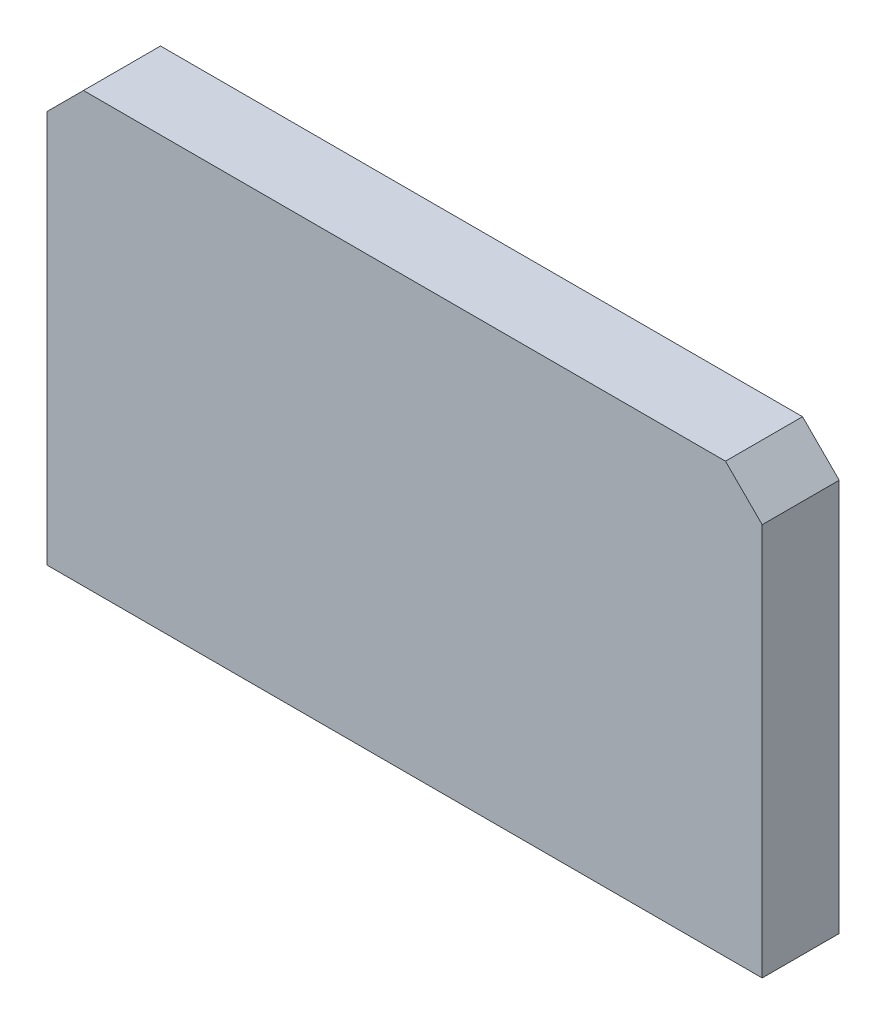
ISO-10303-21;
HEADER;
FILE_DESCRIPTION(('STEP AP214'),'2;1');
FILE_NAME('part.step','',(''),(''),'','','');
FILE_SCHEMA(('AUTOMOTIVE_DESIGN { 1 0 10303 214 1 1 1 1 }'));
ENDSEC;
DATA;
#1=APPLICATION_CONTEXT('core data for automotive mechanical design processes');
#2=APPLICATION_PROTOCOL_DEFINITION('international standard','automotive_design',2000,#1);
#3=PRODUCT_CONTEXT('',#1,'mechanical');
#4=PRODUCT('Part','Part','',(#3));
#5=PRODUCT_RELATED_PRODUCT_CATEGORY('part','',(#4));
#6=PRODUCT_DEFINITION_FORMATION('','',#4);
#7=PRODUCT_DEFINITION_CONTEXT('part definition',#1,'design');
#8=PRODUCT_DEFINITION('design','',#6,#7);
#9=PRODUCT_DEFINITION_SHAPE('','',#8);
#10=(LENGTH_UNIT() NAMED_UNIT(*) SI_UNIT(.MILLI.,.METRE.));
#11=(NAMED_UNIT(*) PLANE_ANGLE_UNIT() SI_UNIT($,.RADIAN.));
#12=(NAMED_UNIT(*) SI_UNIT($,.STERADIAN.) SOLID_ANGLE_UNIT());
#13=UNCERTAINTY_MEASURE_WITH_UNIT(LENGTH_MEASURE(1.E-05),#10,'distance_accuracy_value','');
#14=(GEOMETRIC_REPRESENTATION_CONTEXT(3) GLOBAL_UNCERTAINTY_ASSIGNED_CONTEXT((#13)) GLOBAL_UNIT_ASSIGNED_CONTEXT((#10,
#11,#12)) REPRESENTATION_CONTEXT('',''));
#15=CARTESIAN_POINT('',(0.,0.,0.));
#16=DIRECTION('',(0.,0.,1.));
#17=DIRECTION('',(1.,0.,0.));
#18=AXIS2_PLACEMENT_3D('',#15,#16,#17);
#19=CARTESIAN_POINT('',(-53.5653305643067,-3.20684389745684,0.));
#20=DIRECTION('',(0.,0.,1.));
#21=DIRECTION('',(1.,0.,0.));
#22=AXIS2_PLACEMENT_3D('',#19,#20,#21);
#23=PLANE('',#22);
#24=CARTESIAN_POINT('',(-53.0153305643067,-15.7068438974568,0.));
#25=DIRECTION('',(0.,0.,1.));
#26=DIRECTION('',(1.,0.,0.));
#27=AXIS2_PLACEMENT_3D('',#24,#25,#26);
#28=CIRCLE('',#27,0.925000000000002);
#29=CARTESIAN_POINT('',(-52.0903305643067,-15.7068438974568,0.));
#30=VERTEX_POINT('',#29);
#31=EDGE_CURVE('E141',#30,#30,#28,.F.);
#32=ORIENTED_EDGE('',*,*,#31,.F.);
#33=EDGE_LOOP('',(#32));
#34=FACE_BOUND('',#33,.T.);
#35=CARTESIAN_POINT('',(-53.0153305643067,-11.7068438974568,0.));
#36=DIRECTION('',(0.,0.,1.));
#37=DIRECTION('',(1.,0.,0.));
#38=AXIS2_PLACEMENT_3D('',#35,#36,#37);
#39=CIRCLE('',#38,0.925000000000002);
#40=CARTESIAN_POINT('',(-52.0903305643067,-11.7068438974568,0.));
#41=VERTEX_POINT('',#40);
#42=EDGE_CURVE('E145',#41,#41,#39,.F.);
#43=ORIENTED_EDGE('',*,*,#42,.F.);
#44=EDGE_LOOP('',(#43));
#45=FACE_BOUND('',#44,.T.);
#46=DIRECTION('',(-1.,0.,0.));
#47=VECTOR('',#46,1.);
#48=CARTESIAN_POINT('',(-62.7653305643067,-7.00684389745684,0.));
#49=LINE('',#48,#47);
#50=CARTESIAN_POINT('',(-44.2653305643067,-7.00684389745684,0.));
#51=VERTEX_POINT('',#50);
#52=CARTESIAN_POINT('',(-61.7653305643067,-7.00684389745684,0.));
#53=VERTEX_POINT('',#52);
#54=EDGE_CURVE('E117',#51,#53,#49,.T.);
#55=ORIENTED_EDGE('',*,*,#54,.F.);
#56=DIRECTION('',(-0.707106781186545,0.70710678118655,0.));
#57=VECTOR('',#56,1.);
#58=CARTESIAN_POINT('',(-44.2653305643067,-7.00684389745684,0.));
#59=LINE('',#58,#57);
#60=CARTESIAN_POINT('',(-43.2653305643067,-8.00684389745684,0.));
#61=VERTEX_POINT('',#60);
#62=EDGE_CURVE('E156',#51,#61,#59,.F.);
#63=ORIENTED_EDGE('',*,*,#62,.T.);
#64=DIRECTION('',(0.,1.,0.));
#65=VECTOR('',#64,1.);
#66=CARTESIAN_POINT('',(-43.2653305643067,-7.00684389745684,0.));
#67=LINE('',#66,#65);
#68=CARTESIAN_POINT('',(-43.2653305643067,-18.7068438974568,0.));
#69=VERTEX_POINT('',#68);
#70=EDGE_CURVE('E175',#69,#61,#67,.T.);
#71=ORIENTED_EDGE('',*,*,#70,.F.);
#72=DIRECTION('',(0.707106781186549,0.707106781186546,0.));
#73=VECTOR('',#72,1.);
#74=CARTESIAN_POINT('',(-43.2653305643067,-18.7068438974568,0.));
#75=LINE('',#74,#73);
#76=CARTESIAN_POINT('',(-44.2653305643067,-19.7068438974568,0.));
#77=VERTEX_POINT('',#76);
#78=EDGE_CURVE('E181',#69,#77,#75,.F.);
#79=ORIENTED_EDGE('',*,*,#78,.T.);
#80=DIRECTION('',(1.,0.,0.));
#81=VECTOR('',#80,1.);
#82=CARTESIAN_POINT('',(-62.7653305643067,-19.7068438974568,0.));
#83=LINE('',#82,#81);
#84=CARTESIAN_POINT('',(-61.7653305643067,-19.7068438974568,0.));
#85=VERTEX_POINT('',#84);
#86=EDGE_CURVE('E183',#85,#77,#83,.T.);
#87=ORIENTED_EDGE('',*,*,#86,.F.);
#88=DIRECTION('',(0.707106781186549,-0.707106781186546,0.));
#89=VECTOR('',#88,1.);
#90=CARTESIAN_POINT('',(-61.7653305643067,-19.7068438974568,0.));
#91=LINE('',#90,#89);
#92=CARTESIAN_POINT('',(-62.7653305643067,-18.7068438974568,0.));
#93=VERTEX_POINT('',#92);
#94=EDGE_CURVE('E179',#85,#93,#91,.F.);
#95=ORIENTED_EDGE('',*,*,#94,.T.);
#96=DIRECTION('',(0.,-1.,0.));
#97=VECTOR('',#96,1.);
#98=CARTESIAN_POINT('',(-62.7653305643067,-7.00684389745684,0.));
#99=LINE('',#98,#97);
#100=CARTESIAN_POINT('',(-62.7653305643067,-8.00684389745683,0.));
#101=VERTEX_POINT('',#100);
#102=EDGE_CURVE('E135',#101,#93,#99,.T.);
#103=ORIENTED_EDGE('',*,*,#102,.F.);
#104=DIRECTION('',(-0.707106781186549,-0.707106781186546,0.));
#105=VECTOR('',#104,1.);
#106=CARTESIAN_POINT('',(-62.7653305643067,-8.00684389745683,0.));
#107=LINE('',#106,#105);
#108=EDGE_CURVE('E154',#101,#53,#107,.F.);
#109=ORIENTED_EDGE('',*,*,#108,.T.);
#110=EDGE_LOOP('',(#55,#63,#71,#79,#87,#95,#103,#109));
#111=FACE_BOUND('',#110,.T.);
#112=ADVANCED_FACE('F41',(#34,#45,#111),#23,.F.);
#113=CARTESIAN_POINT('',(-62.7653305643067,-7.00684389745684,2.1));
#114=DIRECTION('',(1.,0.,0.));
#115=DIRECTION('',(0.,0.,-1.));
#116=AXIS2_PLACEMENT_3D('',#113,#114,#115);
#117=PLANE('',#116);
#118=DIRECTION('',(0.,-1.,0.));
#119=VECTOR('',#118,1.);
#120=CARTESIAN_POINT('',(-62.7653305643067,-7.00684389745684,2.1));
#121=LINE('',#120,#119);
#122=CARTESIAN_POINT('',(-62.7653305643067,-8.00684389745683,2.1));
#123=VERTEX_POINT('',#122);
#124=CARTESIAN_POINT('',(-62.7653305643067,-18.7068438974568,2.1));
#125=VERTEX_POINT('',#124);
#126=EDGE_CURVE('E108',#123,#125,#121,.T.);
#127=ORIENTED_EDGE('',*,*,#126,.F.);
#128=DIRECTION('',(0.,0.,-1.));
#129=VECTOR('',#128,1.);
#130=CARTESIAN_POINT('',(-62.7653305643067,-8.00684389745683,2.1));
#131=LINE('',#130,#129);
#132=EDGE_CURVE('E11',#123,#101,#131,.T.);
#133=ORIENTED_EDGE('',*,*,#132,.T.);
#134=ORIENTED_EDGE('',*,*,#102,.T.);
#135=DIRECTION('',(0.,0.,1.));
#136=VECTOR('',#135,1.);
#137=CARTESIAN_POINT('',(-62.7653305643067,-18.7068438974568,2.1));
#138=LINE('',#137,#136);
#139=EDGE_CURVE('E126',#93,#125,#138,.T.);
#140=ORIENTED_EDGE('',*,*,#139,.T.);
#141=EDGE_LOOP('',(#127,#133,#134,#140));
#142=FACE_BOUND('',#141,.T.);
#143=ADVANCED_FACE('F133',(#142),#117,.F.);
#144=CARTESIAN_POINT('',(-62.7653305643067,-19.7068438974568,2.1));
#145=DIRECTION('',(0.,1.,0.));
#146=DIRECTION('',(0.,0.,1.));
#147=AXIS2_PLACEMENT_3D('',#144,#145,#146);
#148=PLANE('',#147);
#149=DIRECTION('',(0.,0.,1.));
#150=VECTOR('',#149,1.);
#151=CARTESIAN_POINT('',(-44.2653305643067,-19.7068438974568,2.1));
#152=LINE('',#151,#150);
#153=CARTESIAN_POINT('',(-44.2653305643067,-19.7068438974568,1.09999999999999));
#154=VERTEX_POINT('',#153);
#155=EDGE_CURVE('E169',#77,#154,#152,.T.);
#156=ORIENTED_EDGE('',*,*,#155,.T.);
#157=DIRECTION('',(-1.,0.,0.));
#158=VECTOR('',#157,1.);
#159=CARTESIAN_POINT('',(-61.7653305643067,-19.7068438974568,1.09999999999999));
#160=LINE('',#159,#158);
#161=CARTESIAN_POINT('',(-61.7653305643067,-19.7068438974568,1.09999999999999));
#162=VERTEX_POINT('',#161);
#163=EDGE_CURVE('E131',#154,#162,#160,.T.);
#164=ORIENTED_EDGE('',*,*,#163,.T.);
#165=DIRECTION('',(0.,0.,-1.));
#166=VECTOR('',#165,1.);
#167=CARTESIAN_POINT('',(-61.7653305643067,-19.7068438974568,2.1));
#168=LINE('',#167,#166);
#169=EDGE_CURVE('E127',#162,#85,#168,.T.);
#170=ORIENTED_EDGE('',*,*,#169,.T.);
#171=ORIENTED_EDGE('',*,*,#86,.T.);
#172=EDGE_LOOP('',(#156,#164,#170,#171));
#173=FACE_BOUND('',#172,.T.);
#174=ADVANCED_FACE('F221',(#173),#148,.F.);
#175=CARTESIAN_POINT('',(0.,0.,2.1));
#176=DIRECTION('',(0.,0.,1.));
#177=DIRECTION('',(1.,0.,0.));
#178=AXIS2_PLACEMENT_3D('',#175,#176,#177);
#179=PLANE('',#178);
#180=DIRECTION('',(0.,1.,0.));
#181=VECTOR('',#180,1.);
#182=CARTESIAN_POINT('',(-43.2653305643067,-7.00684389745684,2.1));
#183=LINE('',#182,#181);
#184=CARTESIAN_POINT('',(-43.2653305643067,-18.7068438974568,2.1));
#185=VERTEX_POINT('',#184);
#186=CARTESIAN_POINT('',(-43.2653305643067,-8.00684389745684,2.1));
#187=VERTEX_POINT('',#186);
#188=EDGE_CURVE('E116',#185,#187,#183,.T.);
#189=ORIENTED_EDGE('',*,*,#188,.T.);
#190=DIRECTION('',(0.707106781186545,-0.70710678118655,0.));
#191=VECTOR('',#190,1.);
#192=CARTESIAN_POINT('',(-25.6360872308819,-25.6360872308817,2.1));
#193=LINE('',#192,#191);
#194=CARTESIAN_POINT('',(-44.2653305643067,-7.00684389745684,2.1));
#195=VERTEX_POINT('',#194);
#196=EDGE_CURVE('E50',#187,#195,#193,.F.);
#197=ORIENTED_EDGE('',*,*,#196,.T.);
#198=DIRECTION('',(-1.,0.,0.));
#199=VECTOR('',#198,1.);
#200=CARTESIAN_POINT('',(-62.7653305643067,-7.00684389745684,2.1));
#201=LINE('',#200,#199);
#202=CARTESIAN_POINT('',(-61.7653305643067,-7.00684389745684,2.1));
#203=VERTEX_POINT('',#202);
#204=EDGE_CURVE('E161',#195,#203,#201,.T.);
#205=ORIENTED_EDGE('',*,*,#204,.T.);
#206=DIRECTION('',(0.707106781186549,0.707106781186546,0.));
#207=VECTOR('',#206,1.);
#208=CARTESIAN_POINT('',(-27.3792433334248,27.3792433334249,2.1));
#209=LINE('',#208,#207);
#210=EDGE_CURVE('E57',#203,#123,#209,.F.);
#211=ORIENTED_EDGE('',*,*,#210,.T.);
#212=ORIENTED_EDGE('',*,*,#126,.T.);
#213=DIRECTION('',(1.,0.,0.));
#214=VECTOR('',#213,1.);
#215=CARTESIAN_POINT('',(-44.2653305643067,-18.7068438974568,2.1));
#216=LINE('',#215,#214);
#217=EDGE_CURVE('E112',#125,#185,#216,.T.);
#218=ORIENTED_EDGE('',*,*,#217,.T.);
#219=EDGE_LOOP('',(#189,#197,#205,#211,#212,#218));
#220=FACE_BOUND('',#219,.T.);
#221=ADVANCED_FACE('F110',(#220),#179,.T.);
#222=CARTESIAN_POINT('',(-43.2653305643067,-7.00684389745684,2.1));
#223=DIRECTION('',(-1.,0.,0.));
#224=DIRECTION('',(0.,0.,1.));
#225=AXIS2_PLACEMENT_3D('',#222,#223,#224);
#226=PLANE('',#225);
#227=ORIENTED_EDGE('',*,*,#70,.T.);
#228=DIRECTION('',(0.,0.,1.));
#229=VECTOR('',#228,1.);
#230=CARTESIAN_POINT('',(-43.2653305643067,-8.00684389745684,2.1));
#231=LINE('',#230,#229);
#232=EDGE_CURVE('E65',#61,#187,#231,.T.);
#233=ORIENTED_EDGE('',*,*,#232,.T.);
#234=ORIENTED_EDGE('',*,*,#188,.F.);
#235=DIRECTION('',(0.,0.,-1.));
#236=VECTOR('',#235,1.);
#237=CARTESIAN_POINT('',(-43.2653305643067,-18.7068438974568,2.1));
#238=LINE('',#237,#236);
#239=EDGE_CURVE('E137',#185,#69,#238,.T.);
#240=ORIENTED_EDGE('',*,*,#239,.T.);
#241=EDGE_LOOP('',(#227,#233,#234,#240));
#242=FACE_BOUND('',#241,.T.);
#243=ADVANCED_FACE('F177',(#242),#226,.F.);
#244=CARTESIAN_POINT('',(-43.2653305643067,-18.7068438974568,2.1));
#245=DIRECTION('',(-0.707106781186546,0.707106781186549,0.));
#246=DIRECTION('',(0.,0.,-1.));
#247=AXIS2_PLACEMENT_3D('',#244,#245,#246);
#248=PLANE('',#247);
#249=ORIENTED_EDGE('',*,*,#239,.F.);
#250=DIRECTION('',(0.577350269189626,0.577350269189624,0.577350269189628));
#251=VECTOR('',#250,1.);
#252=CARTESIAN_POINT('',(-43.2653305643067,-18.7068438974568,2.1));
#253=LINE('',#252,#251);
#254=EDGE_CURVE('E140',#185,#154,#253,.F.);
#255=ORIENTED_EDGE('',*,*,#254,.T.);
#256=ORIENTED_EDGE('',*,*,#155,.F.);
#257=ORIENTED_EDGE('',*,*,#78,.F.);
#258=EDGE_LOOP('',(#249,#255,#256,#257));
#259=FACE_BOUND('',#258,.T.);
#260=ADVANCED_FACE('F234',(#259),#248,.F.);
#261=CARTESIAN_POINT('',(-61.7653305643067,-19.7068438974568,2.1));
#262=DIRECTION('',(0.707106781186546,0.707106781186549,0.));
#263=DIRECTION('',(0.,0.,-1.));
#264=AXIS2_PLACEMENT_3D('',#261,#262,#263);
#265=PLANE('',#264);
#266=ORIENTED_EDGE('',*,*,#169,.F.);
#267=DIRECTION('',(0.577350269189626,-0.577350269189624,-0.577350269189628));
#268=VECTOR('',#267,1.);
#269=CARTESIAN_POINT('',(-62.0986638976401,-19.3735105641235,1.43333333333333));
#270=LINE('',#269,#268);
#271=EDGE_CURVE('E123',#162,#125,#270,.F.);
#272=ORIENTED_EDGE('',*,*,#271,.T.);
#273=ORIENTED_EDGE('',*,*,#139,.F.);
#274=ORIENTED_EDGE('',*,*,#94,.F.);
#275=EDGE_LOOP('',(#266,#272,#273,#274));
#276=FACE_BOUND('',#275,.T.);
#277=ADVANCED_FACE('F124',(#276),#265,.F.);
#278=CARTESIAN_POINT('',(-62.7653305643067,-7.00684389745684,2.1));
#279=DIRECTION('',(0.,-1.,0.));
#280=DIRECTION('',(0.,0.,-1.));
#281=AXIS2_PLACEMENT_3D('',#278,#279,#280);
#282=PLANE('',#281);
#283=ORIENTED_EDGE('',*,*,#204,.F.);
#284=DIRECTION('',(0.,0.,-1.));
#285=VECTOR('',#284,1.);
#286=CARTESIAN_POINT('',(-44.2653305643067,-7.00684389745684,2.1));
#287=LINE('',#286,#285);
#288=EDGE_CURVE('E151',#195,#51,#287,.T.);
#289=ORIENTED_EDGE('',*,*,#288,.T.);
#290=ORIENTED_EDGE('',*,*,#54,.T.);
#291=DIRECTION('',(0.,0.,1.));
#292=VECTOR('',#291,1.);
#293=CARTESIAN_POINT('',(-61.7653305643067,-7.00684389745684,2.1));
#294=LINE('',#293,#292);
#295=EDGE_CURVE('E130',#53,#203,#294,.T.);
#296=ORIENTED_EDGE('',*,*,#295,.T.);
#297=EDGE_LOOP('',(#283,#289,#290,#296));
#298=FACE_BOUND('',#297,.T.);
#299=ADVANCED_FACE('F165',(#298),#282,.F.);
#300=CARTESIAN_POINT('',(-53.0153305643067,-11.7068438974568,0.));
#301=DIRECTION('',(0.,0.,1.));
#302=DIRECTION('',(-1.,0.,0.));
#303=AXIS2_PLACEMENT_3D('',#300,#301,#302);
#304=CONICAL_SURFACE('',#303,0.925000000000002,0.0349065850398866);
#305=CARTESIAN_POINT('',(-53.0153305643067,-11.7068438974568,-2.));
#306=DIRECTION('',(0.,0.,-1.));
#307=DIRECTION('',(-1.,0.,0.));
#308=AXIS2_PLACEMENT_3D('',#305,#306,#307);
#309=CIRCLE('',#308,0.855158461016507);
#310=CARTESIAN_POINT('',(-53.8704890253232,-11.7068438974568,-2.));
#311=VERTEX_POINT('',#310);
#312=EDGE_CURVE('E197',#311,#311,#309,.T.);
#313=ORIENTED_EDGE('',*,*,#312,.F.);
#314=EDGE_LOOP('',(#313));
#315=FACE_BOUND('',#314,.T.);
#316=ORIENTED_EDGE('',*,*,#42,.T.);
#317=EDGE_LOOP('',(#316));
#318=FACE_BOUND('',#317,.T.);
#319=ADVANCED_FACE('F223',(#315,#318),#304,.T.);
#320=CARTESIAN_POINT('',(-53.0153305643067,-11.7068438974568,-2.));
#321=DIRECTION('',(0.,0.,-1.));
#322=DIRECTION('',(-1.,0.,0.));
#323=AXIS2_PLACEMENT_3D('',#320,#321,#322);
#324=PLANE('',#323);
#325=ORIENTED_EDGE('',*,*,#312,.T.);
#326=EDGE_LOOP('',(#325));
#327=FACE_BOUND('',#326,.T.);
#328=ADVANCED_FACE('F211',(#327),#324,.T.);
#329=CARTESIAN_POINT('',(-53.0153305643067,-15.7068438974568,0.));
#330=DIRECTION('',(0.,0.,1.));
#331=DIRECTION('',(-1.,0.,0.));
#332=AXIS2_PLACEMENT_3D('',#329,#330,#331);
#333=CONICAL_SURFACE('',#332,0.925000000000002,0.0349065850398866);
#334=CARTESIAN_POINT('',(-53.0153305643067,-15.7068438974568,-2.));
#335=DIRECTION('',(0.,0.,-1.));
#336=DIRECTION('',(-1.,0.,0.));
#337=AXIS2_PLACEMENT_3D('',#334,#335,#336);
#338=CIRCLE('',#337,0.855158461016507);
#339=CARTESIAN_POINT('',(-53.8704890253232,-15.7068438974568,-2.));
#340=VERTEX_POINT('',#339);
#341=EDGE_CURVE('E202',#340,#340,#338,.T.);
#342=ORIENTED_EDGE('',*,*,#341,.F.);
#343=EDGE_LOOP('',(#342));
#344=FACE_BOUND('',#343,.T.);
#345=ORIENTED_EDGE('',*,*,#31,.T.);
#346=EDGE_LOOP('',(#345));
#347=FACE_BOUND('',#346,.T.);
#348=ADVANCED_FACE('F208',(#344,#347),#333,.T.);
#349=CARTESIAN_POINT('',(-53.0153305643067,-15.7068438974568,-2.));
#350=DIRECTION('',(0.,0.,-1.));
#351=DIRECTION('',(-1.,0.,0.));
#352=AXIS2_PLACEMENT_3D('',#349,#350,#351);
#353=PLANE('',#352);
#354=ORIENTED_EDGE('',*,*,#341,.T.);
#355=EDGE_LOOP('',(#354));
#356=FACE_BOUND('',#355,.T.);
#357=ADVANCED_FACE('F206',(#356),#353,.T.);
#358=CARTESIAN_POINT('',(0.,-18.7068438974568,2.1));
#359=DIRECTION('',(0.,-0.70710678118655,0.707106781186545));
#360=DIRECTION('',(-1.,0.,0.));
#361=AXIS2_PLACEMENT_3D('',#358,#359,#360);
#362=PLANE('',#361);
#363=ORIENTED_EDGE('',*,*,#271,.F.);
#364=ORIENTED_EDGE('',*,*,#163,.F.);
#365=ORIENTED_EDGE('',*,*,#254,.F.);
#366=ORIENTED_EDGE('',*,*,#217,.F.);
#367=EDGE_LOOP('',(#363,#364,#365,#366));
#368=FACE_BOUND('',#367,.T.);
#369=ADVANCED_FACE('F139',(#368),#362,.T.);
#370=CARTESIAN_POINT('',(-44.2653305643067,-7.00684389745684,2.1));
#371=DIRECTION('',(-0.70710678118655,-0.707106781186545,0.));
#372=DIRECTION('',(0.,0.,-1.));
#373=AXIS2_PLACEMENT_3D('',#370,#371,#372);
#374=PLANE('',#373);
#375=ORIENTED_EDGE('',*,*,#196,.F.);
#376=ORIENTED_EDGE('',*,*,#232,.F.);
#377=ORIENTED_EDGE('',*,*,#62,.F.);
#378=ORIENTED_EDGE('',*,*,#288,.F.);
#379=EDGE_LOOP('',(#375,#376,#377,#378));
#380=FACE_BOUND('',#379,.T.);
#381=ADVANCED_FACE('F171',(#380),#374,.F.);
#382=CARTESIAN_POINT('',(-62.7653305643067,-8.00684389745683,2.1));
#383=DIRECTION('',(0.707106781186546,-0.707106781186549,0.));
#384=DIRECTION('',(0.,0.,-1.));
#385=AXIS2_PLACEMENT_3D('',#382,#383,#384);
#386=PLANE('',#385);
#387=ORIENTED_EDGE('',*,*,#210,.F.);
#388=ORIENTED_EDGE('',*,*,#295,.F.);
#389=ORIENTED_EDGE('',*,*,#108,.F.);
#390=ORIENTED_EDGE('',*,*,#132,.F.);
#391=EDGE_LOOP('',(#387,#388,#389,#390));
#392=FACE_BOUND('',#391,.T.);
#393=ADVANCED_FACE('F44',(#392),#386,.F.);
#394=CLOSED_SHELL('',(#112,#143,#174,#221,#243,#260,#277,#299,#319,#328,#348,#357,#369,#381,#393));
#395=MANIFOLD_SOLID_BREP('B2',#394);
#396=ADVANCED_BREP_SHAPE_REPRESENTATION('',(#18,#395),#14);
#397=SHAPE_DEFINITION_REPRESENTATION(#9,#396);
ENDSEC;
END-ISO-10303-21;
